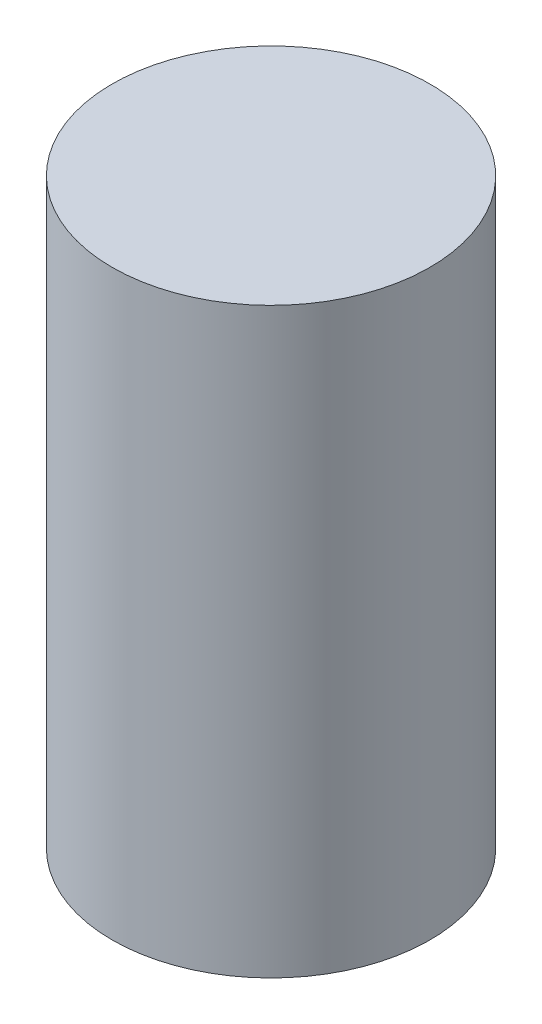
ISO-10303-21;
HEADER;
FILE_DESCRIPTION(('STEP AP214'),'2;1');
FILE_NAME('part.step','',(''),(''),'','','');
FILE_SCHEMA(('AUTOMOTIVE_DESIGN { 1 0 10303 214 1 1 1 1 }'));
ENDSEC;
DATA;
#1=APPLICATION_CONTEXT('core data for automotive mechanical design processes');
#2=APPLICATION_PROTOCOL_DEFINITION('international standard','automotive_design',2000,#1);
#3=PRODUCT_CONTEXT('',#1,'mechanical');
#4=PRODUCT('Part','Part','',(#3));
#5=PRODUCT_RELATED_PRODUCT_CATEGORY('part','',(#4));
#6=PRODUCT_DEFINITION_FORMATION('','',#4);
#7=PRODUCT_DEFINITION_CONTEXT('part definition',#1,'design');
#8=PRODUCT_DEFINITION('design','',#6,#7);
#9=PRODUCT_DEFINITION_SHAPE('','',#8);
#10=(LENGTH_UNIT() NAMED_UNIT(*) SI_UNIT(.MILLI.,.METRE.));
#11=(NAMED_UNIT(*) PLANE_ANGLE_UNIT() SI_UNIT($,.RADIAN.));
#12=(NAMED_UNIT(*) SI_UNIT($,.STERADIAN.) SOLID_ANGLE_UNIT());
#13=UNCERTAINTY_MEASURE_WITH_UNIT(LENGTH_MEASURE(1.E-05),#10,'distance_accuracy_value','');
#14=(GEOMETRIC_REPRESENTATION_CONTEXT(3) GLOBAL_UNCERTAINTY_ASSIGNED_CONTEXT((#13)) GLOBAL_UNIT_ASSIGNED_CONTEXT((#10,
#11,#12)) REPRESENTATION_CONTEXT('',''));
#15=CARTESIAN_POINT('',(0.,0.,0.));
#16=DIRECTION('',(0.,0.,1.));
#17=DIRECTION('',(1.,0.,0.));
#18=AXIS2_PLACEMENT_3D('',#15,#16,#17);
#19=CARTESIAN_POINT('',(0.,33.,0.));
#20=DIRECTION('',(0.,-1.,0.));
#21=DIRECTION('',(0.,0.,-1.));
#22=AXIS2_PLACEMENT_3D('',#19,#20,#21);
#23=CYLINDRICAL_SURFACE('',#22,9.);
#24=CARTESIAN_POINT('',(0.,33.,0.));
#25=DIRECTION('',(0.,1.,0.));
#26=DIRECTION('',(0.,0.,1.));
#27=AXIS2_PLACEMENT_3D('',#24,#25,#26);
#28=CIRCLE('',#27,9.);
#29=CARTESIAN_POINT('',(0.,33.,9.));
#30=VERTEX_POINT('',#29);
#31=EDGE_CURVE('E10',#30,#30,#28,.T.);
#32=ORIENTED_EDGE('',*,*,#31,.F.);
#33=EDGE_LOOP('',(#32));
#34=FACE_BOUND('',#33,.T.);
#35=CARTESIAN_POINT('',(0.,0.,0.));
#36=DIRECTION('',(0.,1.,0.));
#37=DIRECTION('',(0.,0.,1.));
#38=AXIS2_PLACEMENT_3D('',#35,#36,#37);
#39=CIRCLE('',#38,9.);
#40=CARTESIAN_POINT('',(0.,0.,9.));
#41=VERTEX_POINT('',#40);
#42=EDGE_CURVE('E40',#41,#41,#39,.T.);
#43=ORIENTED_EDGE('',*,*,#42,.T.);
#44=EDGE_LOOP('',(#43));
#45=FACE_BOUND('',#44,.T.);
#46=ADVANCED_FACE('F37',(#34,#45),#23,.T.);
#47=CARTESIAN_POINT('',(0.,33.,0.));
#48=DIRECTION('',(0.,1.,0.));
#49=DIRECTION('',(0.,0.,1.));
#50=AXIS2_PLACEMENT_3D('',#47,#48,#49);
#51=PLANE('',#50);
#52=ORIENTED_EDGE('',*,*,#31,.T.);
#53=EDGE_LOOP('',(#52));
#54=FACE_BOUND('',#53,.T.);
#55=ADVANCED_FACE('F54',(#54),#51,.T.);
#56=CARTESIAN_POINT('',(0.,0.,0.));
#57=DIRECTION('',(0.,1.,0.));
#58=DIRECTION('',(0.,0.,1.));
#59=AXIS2_PLACEMENT_3D('',#56,#57,#58);
#60=PLANE('',#59);
#61=ORIENTED_EDGE('',*,*,#42,.F.);
#62=EDGE_LOOP('',(#61));
#63=FACE_BOUND('',#62,.T.);
#64=ADVANCED_FACE('F52',(#63),#60,.F.);
#65=CLOSED_SHELL('',(#46,#55,#64));
#66=MANIFOLD_SOLID_BREP('B2',#65);
#67=ADVANCED_BREP_SHAPE_REPRESENTATION('',(#18,#66),#14);
#68=SHAPE_DEFINITION_REPRESENTATION(#9,#67);
ENDSEC;
END-ISO-10303-21;
